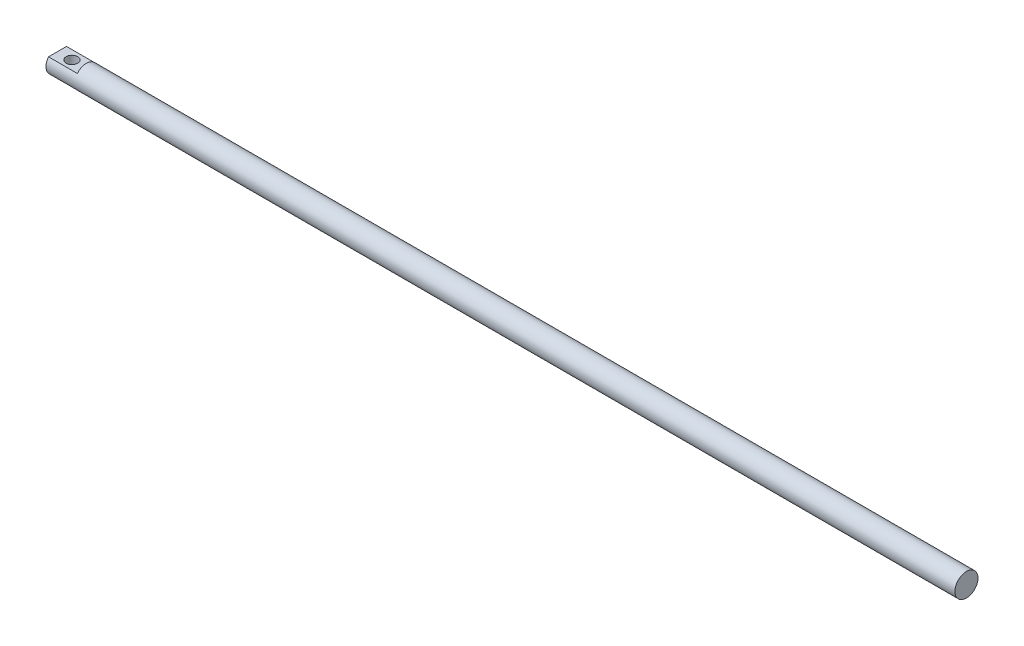
ISO-10303-21;
HEADER;
FILE_DESCRIPTION(('STEP AP214'),'2;1');
FILE_NAME('part.step','',(''),(''),'','','');
FILE_SCHEMA(('AUTOMOTIVE_DESIGN { 1 0 10303 214 1 1 1 1 }'));
ENDSEC;
DATA;
#1=APPLICATION_CONTEXT('core data for automotive mechanical design processes');
#2=APPLICATION_PROTOCOL_DEFINITION('international standard','automotive_design',2000,#1);
#3=PRODUCT_CONTEXT('',#1,'mechanical');
#4=PRODUCT('Part','Part','',(#3));
#5=PRODUCT_RELATED_PRODUCT_CATEGORY('part','',(#4));
#6=PRODUCT_DEFINITION_FORMATION('','',#4);
#7=PRODUCT_DEFINITION_CONTEXT('part definition',#1,'design');
#8=PRODUCT_DEFINITION('design','',#6,#7);
#9=PRODUCT_DEFINITION_SHAPE('','',#8);
#10=(LENGTH_UNIT() NAMED_UNIT(*) SI_UNIT(.MILLI.,.METRE.));
#11=(NAMED_UNIT(*) PLANE_ANGLE_UNIT() SI_UNIT($,.RADIAN.));
#12=(NAMED_UNIT(*) SI_UNIT($,.STERADIAN.) SOLID_ANGLE_UNIT());
#13=UNCERTAINTY_MEASURE_WITH_UNIT(LENGTH_MEASURE(1.E-05),#10,'distance_accuracy_value','');
#14=(GEOMETRIC_REPRESENTATION_CONTEXT(3) GLOBAL_UNCERTAINTY_ASSIGNED_CONTEXT((#13)) GLOBAL_UNIT_ASSIGNED_CONTEXT((#10,
#11,#12)) REPRESENTATION_CONTEXT('',''));
#15=CARTESIAN_POINT('',(0.,0.,0.));
#16=DIRECTION('',(0.,0.,1.));
#17=DIRECTION('',(1.,0.,0.));
#18=AXIS2_PLACEMENT_3D('',#15,#16,#17);
#19=CARTESIAN_POINT('',(630.,0.,0.));
#20=DIRECTION('',(-1.,0.,0.));
#21=DIRECTION('',(0.,0.,1.));
#22=AXIS2_PLACEMENT_3D('',#19,#20,#21);
#23=CYLINDRICAL_SURFACE('',#22,8.);
#24=CARTESIAN_POINT('',(630.,0.,0.));
#25=DIRECTION('',(1.,0.,0.));
#26=DIRECTION('',(0.,0.,-1.));
#27=AXIS2_PLACEMENT_3D('',#24,#25,#26);
#28=CIRCLE('',#27,8.);
#29=CARTESIAN_POINT('',(630.,0.,-8.));
#30=VERTEX_POINT('',#29);
#31=EDGE_CURVE('E84',#30,#30,#28,.T.);
#32=ORIENTED_EDGE('',*,*,#31,.F.);
#33=EDGE_LOOP('',(#32));
#34=FACE_BOUND('',#33,.T.);
#35=DIRECTION('',(-1.,0.,0.));
#36=VECTOR('',#35,1.);
#37=CARTESIAN_POINT('',(630.,5.,-6.2449979983984));
#38=LINE('',#37,#36);
#39=CARTESIAN_POINT('',(20.,5.,-6.2449979983984));
#40=VERTEX_POINT('',#39);
#41=CARTESIAN_POINT('',(0.,5.,-6.2449979983984));
#42=VERTEX_POINT('',#41);
#43=EDGE_CURVE('E58',#40,#42,#38,.T.);
#44=ORIENTED_EDGE('',*,*,#43,.F.);
#45=CARTESIAN_POINT('',(20.,0.,0.));
#46=DIRECTION('',(-1.,0.,0.));
#47=DIRECTION('',(0.,0.,1.));
#48=AXIS2_PLACEMENT_3D('',#45,#46,#47);
#49=CIRCLE('',#48,8.);
#50=CARTESIAN_POINT('',(20.,5.,6.2449979983984));
#51=VERTEX_POINT('',#50);
#52=EDGE_CURVE('E12',#51,#40,#49,.T.);
#53=ORIENTED_EDGE('',*,*,#52,.F.);
#54=DIRECTION('',(-1.,0.,0.));
#55=VECTOR('',#54,1.);
#56=CARTESIAN_POINT('',(630.,5.,6.2449979983984));
#57=LINE('',#56,#55);
#58=CARTESIAN_POINT('',(0.,5.,6.2449979983984));
#59=VERTEX_POINT('',#58);
#60=EDGE_CURVE('E95',#59,#51,#57,.F.);
#61=ORIENTED_EDGE('',*,*,#60,.F.);
#62=CARTESIAN_POINT('',(0.,0.,0.));
#63=DIRECTION('',(1.,0.,0.));
#64=DIRECTION('',(0.,0.,-1.));
#65=AXIS2_PLACEMENT_3D('',#62,#63,#64);
#66=CIRCLE('',#65,8.);
#67=CARTESIAN_POINT('',(0.,-5.,6.2449979983984));
#68=VERTEX_POINT('',#67);
#69=EDGE_CURVE('E93',#59,#68,#66,.T.);
#70=ORIENTED_EDGE('',*,*,#69,.T.);
#71=DIRECTION('',(-1.,0.,0.));
#72=VECTOR('',#71,1.);
#73=CARTESIAN_POINT('',(630.,-5.,6.2449979983984));
#74=LINE('',#73,#72);
#75=CARTESIAN_POINT('',(20.,-5.,6.2449979983984));
#76=VERTEX_POINT('',#75);
#77=EDGE_CURVE('E50',#76,#68,#74,.T.);
#78=ORIENTED_EDGE('',*,*,#77,.F.);
#79=CARTESIAN_POINT('',(20.,-5.,-6.2449979983984));
#80=VERTEX_POINT('',#79);
#81=EDGE_CURVE('E39',#80,#76,#49,.T.);
#82=ORIENTED_EDGE('',*,*,#81,.F.);
#83=DIRECTION('',(-1.,0.,0.));
#84=VECTOR('',#83,1.);
#85=CARTESIAN_POINT('',(630.,-5.,-6.2449979983984));
#86=LINE('',#85,#84);
#87=CARTESIAN_POINT('',(0.,-5.,-6.2449979983984));
#88=VERTEX_POINT('',#87);
#89=EDGE_CURVE('E77',#88,#80,#86,.F.);
#90=ORIENTED_EDGE('',*,*,#89,.F.);
#91=EDGE_CURVE('E89',#88,#42,#66,.T.);
#92=ORIENTED_EDGE('',*,*,#91,.T.);
#93=EDGE_LOOP('',(#44,#53,#61,#70,#78,#82,#90,#92));
#94=FACE_BOUND('',#93,.T.);
#95=ADVANCED_FACE('F36',(#34,#94),#23,.T.);
#96=CARTESIAN_POINT('',(0.,0.,0.));
#97=DIRECTION('',(1.,0.,0.));
#98=DIRECTION('',(0.,0.,-1.));
#99=AXIS2_PLACEMENT_3D('',#96,#97,#98);
#100=PLANE('',#99);
#101=DIRECTION('',(0.,0.,1.));
#102=VECTOR('',#101,1.);
#103=CARTESIAN_POINT('',(0.,5.,0.));
#104=LINE('',#103,#102);
#105=EDGE_CURVE('E83',#42,#59,#104,.T.);
#106=ORIENTED_EDGE('',*,*,#105,.F.);
#107=ORIENTED_EDGE('',*,*,#91,.F.);
#108=DIRECTION('',(0.,0.,-1.));
#109=VECTOR('',#108,1.);
#110=CARTESIAN_POINT('',(0.,-5.,0.));
#111=LINE('',#110,#109);
#112=EDGE_CURVE('E74',#68,#88,#111,.T.);
#113=ORIENTED_EDGE('',*,*,#112,.F.);
#114=ORIENTED_EDGE('',*,*,#69,.F.);
#115=EDGE_LOOP('',(#106,#107,#113,#114));
#116=FACE_BOUND('',#115,.T.);
#117=ADVANCED_FACE('F92',(#116),#100,.F.);
#118=CARTESIAN_POINT('',(630.,0.,0.));
#119=DIRECTION('',(1.,0.,0.));
#120=DIRECTION('',(0.,0.,-1.));
#121=AXIS2_PLACEMENT_3D('',#118,#119,#120);
#122=PLANE('',#121);
#123=ORIENTED_EDGE('',*,*,#31,.T.);
#124=EDGE_LOOP('',(#123));
#125=FACE_BOUND('',#124,.T.);
#126=ADVANCED_FACE('F136',(#125),#122,.T.);
#127=CARTESIAN_POINT('',(20.,-5.,-10.));
#128=DIRECTION('',(0.,-1.,0.));
#129=DIRECTION('',(0.,0.,-1.));
#130=AXIS2_PLACEMENT_3D('',#127,#128,#129);
#131=PLANE('',#130);
#132=CARTESIAN_POINT('',(10.,-5.,0.));
#133=DIRECTION('',(0.,-1.,0.));
#134=DIRECTION('',(0.,0.,-1.));
#135=AXIS2_PLACEMENT_3D('',#132,#133,#134);
#136=CIRCLE('',#135,4.);
#137=CARTESIAN_POINT('',(10.,-5.,-4.));
#138=VERTEX_POINT('',#137);
#139=EDGE_CURVE('E102',#138,#138,#136,.T.);
#140=ORIENTED_EDGE('',*,*,#139,.F.);
#141=EDGE_LOOP('',(#140));
#142=FACE_BOUND('',#141,.T.);
#143=ORIENTED_EDGE('',*,*,#77,.T.);
#144=ORIENTED_EDGE('',*,*,#112,.T.);
#145=ORIENTED_EDGE('',*,*,#89,.T.);
#146=DIRECTION('',(0.,0.,1.));
#147=VECTOR('',#146,1.);
#148=CARTESIAN_POINT('',(20.,-5.,-10.));
#149=LINE('',#148,#147);
#150=EDGE_CURVE('E101',#80,#76,#149,.T.);
#151=ORIENTED_EDGE('',*,*,#150,.T.);
#152=EDGE_LOOP('',(#143,#144,#145,#151));
#153=FACE_BOUND('',#152,.T.);
#154=ADVANCED_FACE('F76',(#142,#153),#131,.T.);
#155=CARTESIAN_POINT('',(20.,0.,0.));
#156=DIRECTION('',(-1.,0.,0.));
#157=DIRECTION('',(0.,0.,1.));
#158=AXIS2_PLACEMENT_3D('',#155,#156,#157);
#159=PLANE('',#158);
#160=ORIENTED_EDGE('',*,*,#81,.T.);
#161=ORIENTED_EDGE('',*,*,#150,.F.);
#162=EDGE_LOOP('',(#160,#161));
#163=FACE_BOUND('',#162,.T.);
#164=ADVANCED_FACE('F100',(#163),#159,.T.);
#165=ORIENTED_EDGE('',*,*,#52,.T.);
#166=DIRECTION('',(0.,0.,-1.));
#167=VECTOR('',#166,1.);
#168=CARTESIAN_POINT('',(20.,5.,-10.));
#169=LINE('',#168,#167);
#170=EDGE_CURVE('E90',#51,#40,#169,.T.);
#171=ORIENTED_EDGE('',*,*,#170,.F.);
#172=EDGE_LOOP('',(#165,#171));
#173=FACE_BOUND('',#172,.T.);
#174=ADVANCED_FACE('F118',(#173),#159,.T.);
#175=CARTESIAN_POINT('',(20.,5.,-10.));
#176=DIRECTION('',(0.,1.,0.));
#177=DIRECTION('',(0.,0.,1.));
#178=AXIS2_PLACEMENT_3D('',#175,#176,#177);
#179=PLANE('',#178);
#180=CARTESIAN_POINT('',(10.,5.,0.));
#181=DIRECTION('',(0.,1.,0.));
#182=DIRECTION('',(0.,0.,1.));
#183=AXIS2_PLACEMENT_3D('',#180,#181,#182);
#184=CIRCLE('',#183,4.);
#185=CARTESIAN_POINT('',(10.,5.,4.));
#186=VERTEX_POINT('',#185);
#187=EDGE_CURVE('E110',#186,#186,#184,.T.);
#188=ORIENTED_EDGE('',*,*,#187,.F.);
#189=EDGE_LOOP('',(#188));
#190=FACE_BOUND('',#189,.T.);
#191=ORIENTED_EDGE('',*,*,#43,.T.);
#192=ORIENTED_EDGE('',*,*,#105,.T.);
#193=ORIENTED_EDGE('',*,*,#60,.T.);
#194=ORIENTED_EDGE('',*,*,#170,.T.);
#195=EDGE_LOOP('',(#191,#192,#193,#194));
#196=FACE_BOUND('',#195,.T.);
#197=ADVANCED_FACE('F116',(#190,#196),#179,.T.);
#198=CARTESIAN_POINT('',(10.,-8.,0.));
#199=DIRECTION('',(0.,1.,0.));
#200=DIRECTION('',(0.,0.,1.));
#201=AXIS2_PLACEMENT_3D('',#198,#199,#200);
#202=CYLINDRICAL_SURFACE('',#201,4.);
#203=ORIENTED_EDGE('',*,*,#139,.T.);
#204=EDGE_LOOP('',(#203));
#205=FACE_BOUND('',#204,.T.);
#206=ORIENTED_EDGE('',*,*,#187,.T.);
#207=EDGE_LOOP('',(#206));
#208=FACE_BOUND('',#207,.T.);
#209=ADVANCED_FACE('F114',(#205,#208),#202,.F.);
#210=CLOSED_SHELL('',(#95,#117,#126,#154,#164,#174,#197,#209));
#211=MANIFOLD_SOLID_BREP('B2',#210);
#212=ADVANCED_BREP_SHAPE_REPRESENTATION('',(#18,#211),#14);
#213=SHAPE_DEFINITION_REPRESENTATION(#9,#212);
ENDSEC;
END-ISO-10303-21;
